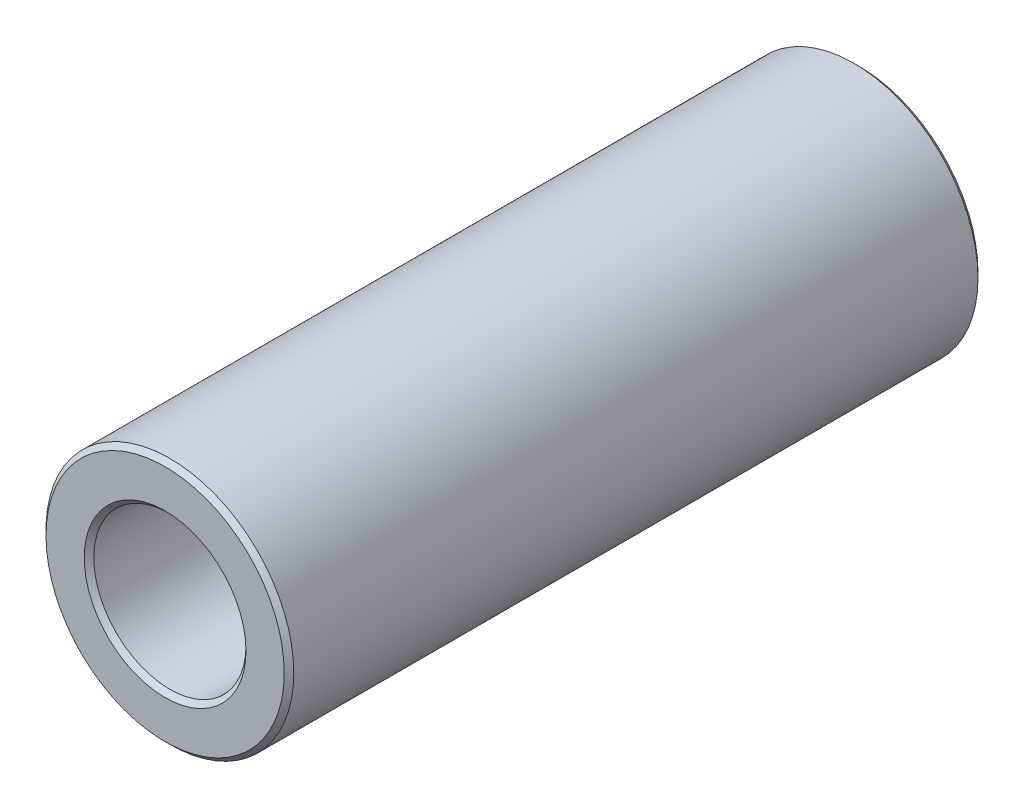
ISO-10303-21;
HEADER;
FILE_DESCRIPTION(('STEP AP214'),'2;1');
FILE_NAME('part.step','',(''),(''),'','','');
FILE_SCHEMA(('AUTOMOTIVE_DESIGN { 1 0 10303 214 1 1 1 1 }'));
ENDSEC;
DATA;
#1=APPLICATION_CONTEXT('core data for automotive mechanical design processes');
#2=APPLICATION_PROTOCOL_DEFINITION('international standard','automotive_design',2000,#1);
#3=PRODUCT_CONTEXT('',#1,'mechanical');
#4=PRODUCT('Part','Part','',(#3));
#5=PRODUCT_RELATED_PRODUCT_CATEGORY('part','',(#4));
#6=PRODUCT_DEFINITION_FORMATION('','',#4);
#7=PRODUCT_DEFINITION_CONTEXT('part definition',#1,'design');
#8=PRODUCT_DEFINITION('design','',#6,#7);
#9=PRODUCT_DEFINITION_SHAPE('','',#8);
#10=(LENGTH_UNIT() NAMED_UNIT(*) SI_UNIT(.MILLI.,.METRE.));
#11=(NAMED_UNIT(*) PLANE_ANGLE_UNIT() SI_UNIT($,.RADIAN.));
#12=(NAMED_UNIT(*) SI_UNIT($,.STERADIAN.) SOLID_ANGLE_UNIT());
#13=UNCERTAINTY_MEASURE_WITH_UNIT(LENGTH_MEASURE(1.E-05),#10,'distance_accuracy_value','');
#14=(GEOMETRIC_REPRESENTATION_CONTEXT(3) GLOBAL_UNCERTAINTY_ASSIGNED_CONTEXT((#13)) GLOBAL_UNIT_ASSIGNED_CONTEXT((#10,
#11,#12)) REPRESENTATION_CONTEXT('',''));
#15=CARTESIAN_POINT('',(0.,0.,0.));
#16=DIRECTION('',(0.,0.,1.));
#17=DIRECTION('',(1.,0.,0.));
#18=AXIS2_PLACEMENT_3D('',#15,#16,#17);
#19=CARTESIAN_POINT('',(0.,0.,-11.1125));
#20=DIRECTION('',(0.,0.,1.));
#21=DIRECTION('',(1.,0.,0.));
#22=AXIS2_PLACEMENT_3D('',#19,#20,#21);
#23=CYLINDRICAL_SURFACE('',#22,3.96875);
#24=CARTESIAN_POINT('',(0.,0.,10.959465));
#25=DIRECTION('',(0.,0.,1.));
#26=DIRECTION('',(1.,0.,0.));
#27=AXIS2_PLACEMENT_3D('',#24,#25,#26);
#28=CIRCLE('',#27,3.96875);
#29=CARTESIAN_POINT('',(3.96875,0.,10.959465));
#30=VERTEX_POINT('',#29);
#31=EDGE_CURVE('E52',#30,#30,#28,.F.);
#32=ORIENTED_EDGE('',*,*,#31,.T.);
#33=EDGE_LOOP('',(#32));
#34=FACE_BOUND('',#33,.T.);
#35=CARTESIAN_POINT('',(0.,0.,-10.959465));
#36=DIRECTION('',(0.,0.,1.));
#37=DIRECTION('',(1.,0.,0.));
#38=AXIS2_PLACEMENT_3D('',#35,#36,#37);
#39=CIRCLE('',#38,3.96875);
#40=CARTESIAN_POINT('',(3.96875,0.,-10.959465));
#41=VERTEX_POINT('',#40);
#42=EDGE_CURVE('E55',#41,#41,#39,.T.);
#43=ORIENTED_EDGE('',*,*,#42,.T.);
#44=EDGE_LOOP('',(#43));
#45=FACE_BOUND('',#44,.T.);
#46=ADVANCED_FACE('F32',(#34,#45),#23,.T.);
#47=CARTESIAN_POINT('',(0.,0.,-11.1125));
#48=DIRECTION('',(0.,0.,1.));
#49=DIRECTION('',(1.,0.,0.));
#50=AXIS2_PLACEMENT_3D('',#47,#48,#49);
#51=PLANE('',#50);
#52=CARTESIAN_POINT('',(0.,0.,-11.1125));
#53=DIRECTION('',(0.,0.,1.));
#54=DIRECTION('',(1.,0.,0.));
#55=AXIS2_PLACEMENT_3D('',#52,#53,#54);
#56=CIRCLE('',#55,3.81571500000001);
#57=CARTESIAN_POINT('',(3.81571500000001,0.,-11.1125));
#58=VERTEX_POINT('',#57);
#59=EDGE_CURVE('E43',#58,#58,#56,.F.);
#60=ORIENTED_EDGE('',*,*,#59,.T.);
#61=EDGE_LOOP('',(#60));
#62=FACE_BOUND('',#61,.T.);
#63=CARTESIAN_POINT('',(0.,0.,-11.1125));
#64=DIRECTION('',(0.,0.,1.));
#65=DIRECTION('',(1.,0.,0.));
#66=AXIS2_PLACEMENT_3D('',#63,#64,#65);
#67=CIRCLE('',#66,2.591435);
#68=CARTESIAN_POINT('',(2.591435,0.,-11.1125));
#69=VERTEX_POINT('',#68);
#70=EDGE_CURVE('E47',#69,#69,#67,.T.);
#71=ORIENTED_EDGE('',*,*,#70,.T.);
#72=EDGE_LOOP('',(#71));
#73=FACE_BOUND('',#72,.T.);
#74=ADVANCED_FACE('F80',(#62,#73),#51,.F.);
#75=CARTESIAN_POINT('',(0.,0.,-11.1125));
#76=DIRECTION('',(0.,0.,1.));
#77=DIRECTION('',(1.,0.,0.));
#78=AXIS2_PLACEMENT_3D('',#75,#76,#77);
#79=CYLINDRICAL_SURFACE('',#78,2.4384);
#80=CARTESIAN_POINT('',(0.,0.,10.959465));
#81=DIRECTION('',(0.,0.,1.));
#82=DIRECTION('',(1.,0.,0.));
#83=AXIS2_PLACEMENT_3D('',#80,#81,#82);
#84=CIRCLE('',#83,2.4384);
#85=CARTESIAN_POINT('',(2.4384,0.,10.959465));
#86=VERTEX_POINT('',#85);
#87=EDGE_CURVE('E10',#86,#86,#84,.T.);
#88=ORIENTED_EDGE('',*,*,#87,.T.);
#89=EDGE_LOOP('',(#88));
#90=FACE_BOUND('',#89,.T.);
#91=CARTESIAN_POINT('',(0.,0.,-10.959465));
#92=DIRECTION('',(0.,0.,1.));
#93=DIRECTION('',(1.,0.,0.));
#94=AXIS2_PLACEMENT_3D('',#91,#92,#93);
#95=CIRCLE('',#94,2.4384);
#96=CARTESIAN_POINT('',(2.4384,0.,-10.959465));
#97=VERTEX_POINT('',#96);
#98=EDGE_CURVE('E39',#97,#97,#95,.F.);
#99=ORIENTED_EDGE('',*,*,#98,.T.);
#100=EDGE_LOOP('',(#99));
#101=FACE_BOUND('',#100,.T.);
#102=ADVANCED_FACE('F86',(#90,#101),#79,.F.);
#103=CARTESIAN_POINT('',(0.,0.,11.1125));
#104=DIRECTION('',(0.,0.,1.));
#105=DIRECTION('',(1.,0.,0.));
#106=AXIS2_PLACEMENT_3D('',#103,#104,#105);
#107=PLANE('',#106);
#108=CARTESIAN_POINT('',(0.,0.,11.1125));
#109=DIRECTION('',(0.,0.,1.));
#110=DIRECTION('',(1.,0.,0.));
#111=AXIS2_PLACEMENT_3D('',#108,#109,#110);
#112=CIRCLE('',#111,3.815715);
#113=CARTESIAN_POINT('',(3.815715,0.,11.1125));
#114=VERTEX_POINT('',#113);
#115=EDGE_CURVE('E58',#114,#114,#112,.T.);
#116=ORIENTED_EDGE('',*,*,#115,.T.);
#117=EDGE_LOOP('',(#116));
#118=FACE_BOUND('',#117,.T.);
#119=CARTESIAN_POINT('',(0.,0.,11.1125));
#120=DIRECTION('',(0.,0.,1.));
#121=DIRECTION('',(1.,0.,0.));
#122=AXIS2_PLACEMENT_3D('',#119,#120,#121);
#123=CIRCLE('',#122,2.591435);
#124=CARTESIAN_POINT('',(2.591435,0.,11.1125));
#125=VERTEX_POINT('',#124);
#126=EDGE_CURVE('E61',#125,#125,#123,.F.);
#127=ORIENTED_EDGE('',*,*,#126,.T.);
#128=EDGE_LOOP('',(#127));
#129=FACE_BOUND('',#128,.T.);
#130=ADVANCED_FACE('F65',(#118,#129),#107,.T.);
#131=CARTESIAN_POINT('',(0.,0.,11.1125));
#132=DIRECTION('',(0.,0.,-1.));
#133=DIRECTION('',(-1.,0.,0.));
#134=AXIS2_PLACEMENT_3D('',#131,#132,#133);
#135=CONICAL_SURFACE('',#134,3.815715,0.785398163397437);
#136=ORIENTED_EDGE('',*,*,#31,.F.);
#137=EDGE_LOOP('',(#136));
#138=FACE_BOUND('',#137,.T.);
#139=ORIENTED_EDGE('',*,*,#115,.F.);
#140=EDGE_LOOP('',(#139));
#141=FACE_BOUND('',#140,.T.);
#142=ADVANCED_FACE('F76',(#138,#141),#135,.T.);
#143=CARTESIAN_POINT('',(0.,0.,-10.959465));
#144=DIRECTION('',(0.,0.,1.));
#145=DIRECTION('',(1.,0.,0.));
#146=AXIS2_PLACEMENT_3D('',#143,#144,#145);
#147=CONICAL_SURFACE('',#146,3.96875,0.785398163397437);
#148=ORIENTED_EDGE('',*,*,#59,.F.);
#149=EDGE_LOOP('',(#148));
#150=FACE_BOUND('',#149,.T.);
#151=ORIENTED_EDGE('',*,*,#42,.F.);
#152=EDGE_LOOP('',(#151));
#153=FACE_BOUND('',#152,.T.);
#154=ADVANCED_FACE('F70',(#150,#153),#147,.T.);
#155=CARTESIAN_POINT('',(0.,0.,10.959465));
#156=DIRECTION('',(0.,0.,1.));
#157=DIRECTION('',(1.,0.,0.));
#158=AXIS2_PLACEMENT_3D('',#155,#156,#157);
#159=CONICAL_SURFACE('',#158,2.4384,0.785398163397437);
#160=CARTESIAN_POINT('',(2.591435,0.,11.1125));
#161=CARTESIAN_POINT('',(2.58984088541666,0.,11.1109058854167));
#162=CARTESIAN_POINT('',(2.58824677083333,0.,11.1093117708333));
#163=CARTESIAN_POINT('',(2.58505854166666,0.,11.1061235416667));
#164=CARTESIAN_POINT('',(2.58346442708333,0.,11.1045294270833));
#165=CARTESIAN_POINT('',(2.58027619791666,0.,11.1013411979167));
#166=CARTESIAN_POINT('',(2.57868208333333,0.,11.0997470833333));
#167=CARTESIAN_POINT('',(2.57549385416666,0.,11.0965588541667));
#168=CARTESIAN_POINT('',(2.57389973958333,0.,11.0949647395833));
#169=CARTESIAN_POINT('',(2.57071151041666,0.,11.0917765104167));
#170=CARTESIAN_POINT('',(2.56911739583333,0.,11.0901823958333));
#171=CARTESIAN_POINT('',(2.56592916666666,0.,11.0869941666667));
#172=CARTESIAN_POINT('',(2.56433505208333,0.,11.0854000520833));
#173=CARTESIAN_POINT('',(2.56114682291666,0.,11.0822118229167));
#174=CARTESIAN_POINT('',(2.55955270833333,0.,11.0806177083333));
#175=CARTESIAN_POINT('',(2.55636447916666,0.,11.0774294791667));
#176=CARTESIAN_POINT('',(2.55477036458333,0.,11.0758353645833));
#177=CARTESIAN_POINT('',(2.55158213541666,0.,11.0726471354167));
#178=CARTESIAN_POINT('',(2.54998802083333,0.,11.0710530208333));
#179=CARTESIAN_POINT('',(2.54679979166666,0.,11.0678647916667));
#180=CARTESIAN_POINT('',(2.54520567708333,0.,11.0662706770833));
#181=CARTESIAN_POINT('',(2.54201744791666,0.,11.0630824479167));
#182=CARTESIAN_POINT('',(2.54042333333333,0.,11.0614883333333));
#183=CARTESIAN_POINT('',(2.53723510416666,0.,11.0583001041667));
#184=CARTESIAN_POINT('',(2.53564098958333,0.,11.0567059895833));
#185=CARTESIAN_POINT('',(2.53245276041666,0.,11.0535177604167));
#186=CARTESIAN_POINT('',(2.53085864583333,0.,11.0519236458333));
#187=CARTESIAN_POINT('',(2.52767041666666,0.,11.0487354166667));
#188=CARTESIAN_POINT('',(2.52607630208333,0.,11.0471413020833));
#189=CARTESIAN_POINT('',(2.52288807291666,0.,11.0439530729167));
#190=CARTESIAN_POINT('',(2.52129395833333,0.,11.0423589583333));
#191=CARTESIAN_POINT('',(2.51810572916666,0.,11.0391707291667));
#192=CARTESIAN_POINT('',(2.51651161458333,0.,11.0375766145833));
#193=CARTESIAN_POINT('',(2.51332338541666,0.,11.0343883854167));
#194=CARTESIAN_POINT('',(2.51172927083333,0.,11.0327942708333));
#195=CARTESIAN_POINT('',(2.50854104166666,0.,11.0296060416667));
#196=CARTESIAN_POINT('',(2.50694692708333,0.,11.0280119270833));
#197=CARTESIAN_POINT('',(2.50375869791666,0.,11.0248236979167));
#198=CARTESIAN_POINT('',(2.50216458333333,0.,11.0232295833333));
#199=CARTESIAN_POINT('',(2.49897635416666,0.,11.0200413541667));
#200=CARTESIAN_POINT('',(2.49738223958333,0.,11.0184472395833));
#201=CARTESIAN_POINT('',(2.49419401041666,0.,11.0152590104167));
#202=CARTESIAN_POINT('',(2.49259989583333,0.,11.0136648958333));
#203=CARTESIAN_POINT('',(2.48941166666666,0.,11.0104766666667));
#204=CARTESIAN_POINT('',(2.48781755208333,0.,11.0088825520833));
#205=CARTESIAN_POINT('',(2.48462932291666,0.,11.0056943229167));
#206=CARTESIAN_POINT('',(2.48303520833333,0.,11.0041002083333));
#207=CARTESIAN_POINT('',(2.47984697916666,0.,11.0009119791667));
#208=CARTESIAN_POINT('',(2.47825286458333,0.,10.9993178645833));
#209=CARTESIAN_POINT('',(2.47506463541667,0.,10.9961296354167));
#210=CARTESIAN_POINT('',(2.47347052083333,0.,10.9945355208333));
#211=CARTESIAN_POINT('',(2.47028229166667,0.,10.9913472916667));
#212=CARTESIAN_POINT('',(2.46868817708333,0.,10.9897531770833));
#213=CARTESIAN_POINT('',(2.46549994791667,0.,10.9865649479167));
#214=CARTESIAN_POINT('',(2.46390583333333,0.,10.9849708333333));
#215=CARTESIAN_POINT('',(2.46071760416667,0.,10.9817826041667));
#216=CARTESIAN_POINT('',(2.45912348958333,0.,10.9801884895833));
#217=CARTESIAN_POINT('',(2.45593526041667,0.,10.9770002604167));
#218=CARTESIAN_POINT('',(2.45434114583333,0.,10.9754061458333));
#219=CARTESIAN_POINT('',(2.45115291666667,0.,10.9722179166667));
#220=CARTESIAN_POINT('',(2.44955880208333,0.,10.9706238020833));
#221=CARTESIAN_POINT('',(2.44637057291667,0.,10.9674355729167));
#222=CARTESIAN_POINT('',(2.44477645833333,0.,10.9658414583333));
#223=CARTESIAN_POINT('',(2.44158822916667,0.,10.9626532291667));
#224=CARTESIAN_POINT('',(2.43999411458333,0.,10.9610591145833));
#225=CARTESIAN_POINT('',(2.4384,0.,10.959465));
#226=B_SPLINE_CURVE_WITH_KNOTS('',3,(#160,#161,#162,#163,#164,#165,#166,#167,#168,#169,#170,
#171,#172,#173,#174,#175,#176,#177,#178,#179,#180,#181,#182,#183,#184,#185,#186,#187,#188,#189,
#190,#191,#192,#193,#194,#195,#196,#197,#198,#199,#200,#201,#202,#203,#204,#205,#206,#207,#208,
#209,#210,#211,#212,#213,#214,#215,#216,#217,#218,#219,#220,#221,#222,#223,#224,#225),
.UNSPECIFIED.,.F.,.F.,(4,2,2,2,2,2,2,2,2,2,2,2,2,2,2,2,2,2,2,2,2,2,2,2,2,2,2,2,2,2,2,2,4),(0.,
0.00676325539118063,0.0135265107823613,0.0202897661735407,0.0270530215647213,0.0338162769559007,
0.0405795323470814,0.0473427877382608,0.0541060431294414,0.060869298520622,0.0676325539118014,
0.0743958093029821,0.0811590646941615,0.0879223200853421,0.0946855754765215,0.101448830867702,
0.108212086258882,0.114975341650062,0.121738597041243,0.128501852432422,0.135265107823603,
0.142028363214782,0.148791618605963,0.155554873997142,0.162318129388323,0.169081384779504,
0.175844640170683,0.182607895561864,0.189371150953043,0.196134406344224,0.202897661735403,
0.209660917126584,0.216424172517763),.UNSPECIFIED.);
#227=EDGE_CURVE('BSEAM67',#125,#86,#226,.T.);
#228=ORIENTED_EDGE('',*,*,#126,.F.);
#229=ORIENTED_EDGE('',*,*,#87,.F.);
#230=ORIENTED_EDGE('',*,*,#227,.T.);
#231=ORIENTED_EDGE('',*,*,#227,.F.);
#232=EDGE_LOOP('',(#228,#230,#229,#231));
#233=FACE_BOUND('',#232,.T.);
#234=ADVANCED_FACE('F67',(#233),#159,.F.);
#235=CARTESIAN_POINT('',(0.,0.,-11.1125));
#236=DIRECTION('',(0.,0.,-1.));
#237=DIRECTION('',(-1.,0.,0.));
#238=AXIS2_PLACEMENT_3D('',#235,#236,#237);
#239=CONICAL_SURFACE('',#238,2.591435,0.785398163397448);
#240=ORIENTED_EDGE('',*,*,#98,.F.);
#241=EDGE_LOOP('',(#240));
#242=FACE_BOUND('',#241,.T.);
#243=ORIENTED_EDGE('',*,*,#70,.F.);
#244=EDGE_LOOP('',(#243));
#245=FACE_BOUND('',#244,.T.);
#246=ADVANCED_FACE('F34',(#242,#245),#239,.F.);
#247=CLOSED_SHELL('',(#46,#74,#102,#130,#142,#154,#234,#246));
#248=MANIFOLD_SOLID_BREP('B2',#247);
#249=ADVANCED_BREP_SHAPE_REPRESENTATION('',(#18,#248),#14);
#250=SHAPE_DEFINITION_REPRESENTATION(#9,#249);
ENDSEC;
END-ISO-10303-21;
